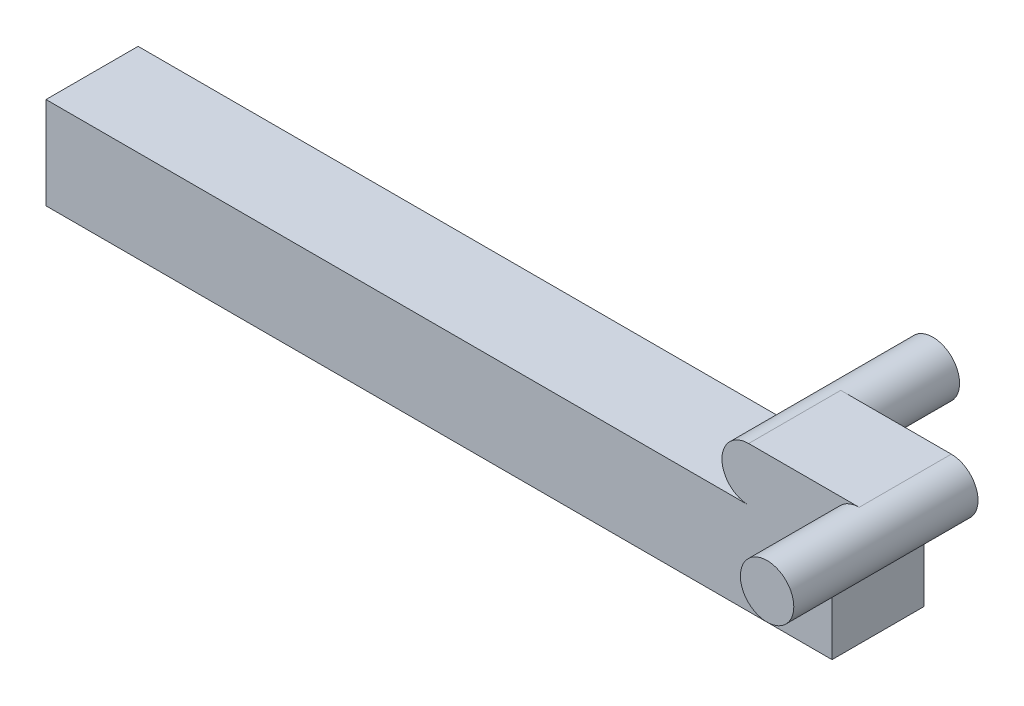
ISO-10303-21;
HEADER;
FILE_DESCRIPTION(('STEP AP214'),'2;1');
FILE_NAME('part.step','',(''),(''),'','','');
FILE_SCHEMA(('AUTOMOTIVE_DESIGN { 1 0 10303 214 1 1 1 1 }'));
ENDSEC;
DATA;
#1=APPLICATION_CONTEXT('core data for automotive mechanical design processes');
#2=APPLICATION_PROTOCOL_DEFINITION('international standard','automotive_design',2000,#1);
#3=PRODUCT_CONTEXT('',#1,'mechanical');
#4=PRODUCT('Part','Part','',(#3));
#5=PRODUCT_RELATED_PRODUCT_CATEGORY('part','',(#4));
#6=PRODUCT_DEFINITION_FORMATION('','',#4);
#7=PRODUCT_DEFINITION_CONTEXT('part definition',#1,'design');
#8=PRODUCT_DEFINITION('design','',#6,#7);
#9=PRODUCT_DEFINITION_SHAPE('','',#8);
#10=(LENGTH_UNIT() NAMED_UNIT(*) SI_UNIT(.MILLI.,.METRE.));
#11=(NAMED_UNIT(*) PLANE_ANGLE_UNIT() SI_UNIT($,.RADIAN.));
#12=(NAMED_UNIT(*) SI_UNIT($,.STERADIAN.) SOLID_ANGLE_UNIT());
#13=UNCERTAINTY_MEASURE_WITH_UNIT(LENGTH_MEASURE(1.E-05),#10,'distance_accuracy_value','');
#14=(GEOMETRIC_REPRESENTATION_CONTEXT(3) GLOBAL_UNCERTAINTY_ASSIGNED_CONTEXT((#13)) GLOBAL_UNIT_ASSIGNED_CONTEXT((#10,
#11,#12)) REPRESENTATION_CONTEXT('',''));
#15=CARTESIAN_POINT('',(0.,0.,0.));
#16=DIRECTION('',(0.,0.,1.));
#17=DIRECTION('',(1.,0.,0.));
#18=AXIS2_PLACEMENT_3D('',#15,#16,#17);
#19=CARTESIAN_POINT('',(0.,-1.45,5.));
#20=DIRECTION('',(0.,1.,0.));
#21=DIRECTION('',(0.,0.,1.));
#22=AXIS2_PLACEMENT_3D('',#19,#20,#21);
#23=PLANE('',#22);
#24=DIRECTION('',(0.,0.,1.));
#25=VECTOR('',#24,1.);
#26=CARTESIAN_POINT('',(4.5259378054856,-1.45,5.));
#27=LINE('',#26,#25);
#28=CARTESIAN_POINT('',(4.5259378054856,-1.45,0.));
#29=VERTEX_POINT('',#28);
#30=CARTESIAN_POINT('',(4.5259378054856,-1.45,5.));
#31=VERTEX_POINT('',#30);
#32=EDGE_CURVE('E149',#29,#31,#27,.T.);
#33=ORIENTED_EDGE('',*,*,#32,.F.);
#34=DIRECTION('',(1.,0.,0.));
#35=VECTOR('',#34,1.);
#36=CARTESIAN_POINT('',(0.,-1.45,0.));
#37=LINE('',#36,#35);
#38=CARTESIAN_POINT('',(6.,-1.45,0.));
#39=VERTEX_POINT('',#38);
#40=EDGE_CURVE('E93',#29,#39,#37,.T.);
#41=ORIENTED_EDGE('',*,*,#40,.T.);
#42=DIRECTION('',(0.,0.,-1.));
#43=VECTOR('',#42,1.);
#44=CARTESIAN_POINT('',(6.,-1.45,5.));
#45=LINE('',#44,#43);
#46=CARTESIAN_POINT('',(6.,-1.45,5.));
#47=VERTEX_POINT('',#46);
#48=EDGE_CURVE('E52',#47,#39,#45,.T.);
#49=ORIENTED_EDGE('',*,*,#48,.F.);
#50=DIRECTION('',(1.,0.,0.));
#51=VECTOR('',#50,1.);
#52=CARTESIAN_POINT('',(0.,-1.45,5.));
#53=LINE('',#52,#51);
#54=EDGE_CURVE('E112',#31,#47,#53,.T.);
#55=ORIENTED_EDGE('',*,*,#54,.F.);
#56=EDGE_LOOP('',(#33,#41,#49,#55));
#57=FACE_BOUND('',#56,.T.);
#58=ADVANCED_FACE('F43',(#57),#23,.F.);
#59=CARTESIAN_POINT('',(0.,0.,0.));
#60=DIRECTION('',(0.,0.,1.));
#61=DIRECTION('',(1.,0.,0.));
#62=AXIS2_PLACEMENT_3D('',#59,#60,#61);
#63=PLANE('',#62);
#64=CARTESIAN_POINT('',(0.,0.,0.));
#65=DIRECTION('',(0.,0.,-1.));
#66=DIRECTION('',(-1.,0.,0.));
#67=AXIS2_PLACEMENT_3D('',#64,#65,#66);
#68=CIRCLE('',#67,1.45);
#69=CARTESIAN_POINT('',(0.,1.45,0.));
#70=VERTEX_POINT('',#69);
#71=CARTESIAN_POINT('',(0.,-1.45,0.));
#72=VERTEX_POINT('',#71);
#73=EDGE_CURVE('E107',#70,#72,#68,.T.);
#74=ORIENTED_EDGE('',*,*,#73,.F.);
#75=DIRECTION('',(-1.,0.,0.));
#76=VECTOR('',#75,1.);
#77=CARTESIAN_POINT('',(0.,1.45,0.));
#78=LINE('',#77,#76);
#79=CARTESIAN_POINT('',(6.,1.45,0.));
#80=VERTEX_POINT('',#79);
#81=EDGE_CURVE('E92',#80,#70,#78,.T.);
#82=ORIENTED_EDGE('',*,*,#81,.F.);
#83=CARTESIAN_POINT('',(6.,0.,0.));
#84=DIRECTION('',(0.,0.,1.));
#85=DIRECTION('',(1.,0.,0.));
#86=AXIS2_PLACEMENT_3D('',#83,#84,#85);
#87=CIRCLE('',#86,1.45);
#88=EDGE_CURVE('E81',#39,#80,#87,.T.);
#89=ORIENTED_EDGE('',*,*,#88,.F.);
#90=ORIENTED_EDGE('',*,*,#40,.F.);
#91=DIRECTION('',(0.,1.,0.));
#92=VECTOR('',#91,1.);
#93=CARTESIAN_POINT('',(4.5259378054856,-6.45,0.));
#94=LINE('',#93,#92);
#95=CARTESIAN_POINT('',(4.5259378054856,-6.45,0.));
#96=VERTEX_POINT('',#95);
#97=EDGE_CURVE('E139',#96,#29,#94,.T.);
#98=ORIENTED_EDGE('',*,*,#97,.F.);
#99=DIRECTION('',(1.,0.,0.));
#100=VECTOR('',#99,1.);
#101=CARTESIAN_POINT('',(1.8555466458858,-6.45,0.));
#102=LINE('',#101,#100);
#103=CARTESIAN_POINT('',(-38.1444533541142,-6.45,0.));
#104=VERTEX_POINT('',#103);
#105=EDGE_CURVE('E152',#104,#96,#102,.T.);
#106=ORIENTED_EDGE('',*,*,#105,.F.);
#107=DIRECTION('',(0.,-1.,0.));
#108=VECTOR('',#107,1.);
#109=CARTESIAN_POINT('',(-38.1444533541142,-1.45,0.));
#110=LINE('',#109,#108);
#111=CARTESIAN_POINT('',(-38.1444533541142,-1.45,0.));
#112=VERTEX_POINT('',#111);
#113=EDGE_CURVE('E174',#112,#104,#110,.T.);
#114=ORIENTED_EDGE('',*,*,#113,.F.);
#115=DIRECTION('',(1.,0.,0.));
#116=VECTOR('',#115,1.);
#117=CARTESIAN_POINT('',(-38.1444533541142,-1.45,0.));
#118=LINE('',#117,#116);
#119=EDGE_CURVE('E167',#112,#72,#118,.T.);
#120=ORIENTED_EDGE('',*,*,#119,.T.);
#121=EDGE_LOOP('',(#74,#82,#89,#90,#98,#106,#114,#120));
#122=FACE_BOUND('',#121,.T.);
#123=ADVANCED_FACE('F104',(#122),#63,.F.);
#124=CARTESIAN_POINT('',(0.,0.,5.));
#125=DIRECTION('',(0.,0.,-1.));
#126=DIRECTION('',(-1.,0.,0.));
#127=AXIS2_PLACEMENT_3D('',#124,#125,#126);
#128=CYLINDRICAL_SURFACE('',#127,1.45);
#129=DIRECTION('',(0.,0.,-1.));
#130=VECTOR('',#129,1.);
#131=CARTESIAN_POINT('',(0.,1.45,5.));
#132=LINE('',#131,#130);
#133=CARTESIAN_POINT('',(0.,1.45,5.));
#134=VERTEX_POINT('',#133);
#135=EDGE_CURVE('E101',#134,#70,#132,.T.);
#136=ORIENTED_EDGE('',*,*,#135,.T.);
#137=ORIENTED_EDGE('',*,*,#73,.T.);
#138=DIRECTION('',(0.,0.,-1.));
#139=VECTOR('',#138,1.);
#140=CARTESIAN_POINT('',(0.,-1.45,5.));
#141=LINE('',#140,#139);
#142=CARTESIAN_POINT('',(0.,-1.45,5.));
#143=VERTEX_POINT('',#142);
#144=EDGE_CURVE('E11',#143,#72,#141,.T.);
#145=ORIENTED_EDGE('',*,*,#144,.F.);
#146=CARTESIAN_POINT('',(0.,0.,5.));
#147=DIRECTION('',(0.,0.,1.));
#148=DIRECTION('',(1.,0.,0.));
#149=AXIS2_PLACEMENT_3D('',#146,#147,#148);
#150=CIRCLE('',#149,1.45);
#151=EDGE_CURVE('E109',#134,#143,#150,.T.);
#152=ORIENTED_EDGE('',*,*,#151,.F.);
#153=EDGE_LOOP('',(#136,#137,#145,#152));
#154=FACE_BOUND('',#153,.T.);
#155=CARTESIAN_POINT('',(0.,0.,-5.));
#156=DIRECTION('',(0.,0.,-1.));
#157=DIRECTION('',(-1.,0.,0.));
#158=AXIS2_PLACEMENT_3D('',#155,#156,#157);
#159=CIRCLE('',#158,1.45);
#160=CARTESIAN_POINT('',(-1.45,0.,-5.));
#161=VERTEX_POINT('',#160);
#162=EDGE_CURVE('E135',#161,#161,#159,.T.);
#163=ORIENTED_EDGE('',*,*,#162,.F.);
#164=EDGE_LOOP('',(#163));
#165=FACE_BOUND('',#164,.T.);
#166=ADVANCED_FACE('F45',(#154,#165),#128,.T.);
#167=CARTESIAN_POINT('',(6.,0.,5.));
#168=DIRECTION('',(0.,0.,-1.));
#169=DIRECTION('',(-1.,0.,0.));
#170=AXIS2_PLACEMENT_3D('',#167,#168,#169);
#171=CYLINDRICAL_SURFACE('',#170,1.45);
#172=ORIENTED_EDGE('',*,*,#88,.T.);
#173=DIRECTION('',(0.,0.,-1.));
#174=VECTOR('',#173,1.);
#175=CARTESIAN_POINT('',(6.,1.45,5.));
#176=LINE('',#175,#174);
#177=CARTESIAN_POINT('',(6.,1.45,5.));
#178=VERTEX_POINT('',#177);
#179=EDGE_CURVE('E86',#178,#80,#176,.T.);
#180=ORIENTED_EDGE('',*,*,#179,.F.);
#181=CARTESIAN_POINT('',(6.,0.,5.));
#182=DIRECTION('',(0.,0.,1.));
#183=DIRECTION('',(1.,0.,0.));
#184=AXIS2_PLACEMENT_3D('',#181,#182,#183);
#185=CIRCLE('',#184,1.45);
#186=EDGE_CURVE('E130',#178,#47,#185,.T.);
#187=ORIENTED_EDGE('',*,*,#186,.T.);
#188=ORIENTED_EDGE('',*,*,#48,.T.);
#189=EDGE_LOOP('',(#172,#180,#187,#188));
#190=FACE_BOUND('',#189,.T.);
#191=CARTESIAN_POINT('',(6.,0.,10.));
#192=DIRECTION('',(0.,0.,1.));
#193=DIRECTION('',(1.,0.,0.));
#194=AXIS2_PLACEMENT_3D('',#191,#192,#193);
#195=CIRCLE('',#194,1.45);
#196=CARTESIAN_POINT('',(7.45,0.,10.));
#197=VERTEX_POINT('',#196);
#198=EDGE_CURVE('E125',#197,#197,#195,.T.);
#199=ORIENTED_EDGE('',*,*,#198,.F.);
#200=EDGE_LOOP('',(#199));
#201=FACE_BOUND('',#200,.T.);
#202=ADVANCED_FACE('F83',(#190,#201),#171,.T.);
#203=CARTESIAN_POINT('',(0.,1.45,5.));
#204=DIRECTION('',(0.,-1.,0.));
#205=DIRECTION('',(0.,0.,-1.));
#206=AXIS2_PLACEMENT_3D('',#203,#204,#205);
#207=PLANE('',#206);
#208=ORIENTED_EDGE('',*,*,#81,.T.);
#209=ORIENTED_EDGE('',*,*,#135,.F.);
#210=DIRECTION('',(-1.,0.,0.));
#211=VECTOR('',#210,1.);
#212=CARTESIAN_POINT('',(0.,1.45,5.));
#213=LINE('',#212,#211);
#214=EDGE_CURVE('E67',#178,#134,#213,.T.);
#215=ORIENTED_EDGE('',*,*,#214,.F.);
#216=ORIENTED_EDGE('',*,*,#179,.T.);
#217=EDGE_LOOP('',(#208,#209,#215,#216));
#218=FACE_BOUND('',#217,.T.);
#219=ADVANCED_FACE('F97',(#218),#207,.F.);
#220=CARTESIAN_POINT('',(0.,0.,5.));
#221=DIRECTION('',(0.,0.,1.));
#222=DIRECTION('',(1.,0.,0.));
#223=AXIS2_PLACEMENT_3D('',#220,#221,#222);
#224=PLANE('',#223);
#225=ORIENTED_EDGE('',*,*,#186,.F.);
#226=ORIENTED_EDGE('',*,*,#214,.T.);
#227=ORIENTED_EDGE('',*,*,#151,.T.);
#228=DIRECTION('',(1.,0.,0.));
#229=VECTOR('',#228,1.);
#230=CARTESIAN_POINT('',(-38.1444533541142,-1.45,5.));
#231=LINE('',#230,#229);
#232=CARTESIAN_POINT('',(-38.1444533541142,-1.45,5.));
#233=VERTEX_POINT('',#232);
#234=EDGE_CURVE('E153',#233,#143,#231,.T.);
#235=ORIENTED_EDGE('',*,*,#234,.F.);
#236=DIRECTION('',(0.,1.,0.));
#237=VECTOR('',#236,1.);
#238=CARTESIAN_POINT('',(-38.1444533541142,-1.45,5.));
#239=LINE('',#238,#237);
#240=CARTESIAN_POINT('',(-38.1444533541142,-6.45,5.));
#241=VERTEX_POINT('',#240);
#242=EDGE_CURVE('E182',#241,#233,#239,.T.);
#243=ORIENTED_EDGE('',*,*,#242,.F.);
#244=DIRECTION('',(-1.,0.,0.));
#245=VECTOR('',#244,1.);
#246=CARTESIAN_POINT('',(1.8555466458858,-6.45,5.));
#247=LINE('',#246,#245);
#248=CARTESIAN_POINT('',(4.5259378054856,-6.45,5.));
#249=VERTEX_POINT('',#248);
#250=EDGE_CURVE('E148',#249,#241,#247,.T.);
#251=ORIENTED_EDGE('',*,*,#250,.F.);
#252=DIRECTION('',(0.,1.,0.));
#253=VECTOR('',#252,1.);
#254=CARTESIAN_POINT('',(4.5259378054856,-6.45,5.));
#255=LINE('',#254,#253);
#256=EDGE_CURVE('E59',#249,#31,#255,.T.);
#257=ORIENTED_EDGE('',*,*,#256,.T.);
#258=ORIENTED_EDGE('',*,*,#54,.T.);
#259=EDGE_LOOP('',(#225,#226,#227,#235,#243,#251,#257,#258));
#260=FACE_BOUND('',#259,.T.);
#261=ADVANCED_FACE('F196',(#260),#224,.T.);
#262=CARTESIAN_POINT('',(6.,0.,10.));
#263=DIRECTION('',(0.,0.,1.));
#264=DIRECTION('',(1.,0.,0.));
#265=AXIS2_PLACEMENT_3D('',#262,#263,#264);
#266=PLANE('',#265);
#267=ORIENTED_EDGE('',*,*,#198,.T.);
#268=EDGE_LOOP('',(#267));
#269=FACE_BOUND('',#268,.T.);
#270=ADVANCED_FACE('F234',(#269),#266,.T.);
#271=CARTESIAN_POINT('',(0.,0.,-5.));
#272=DIRECTION('',(0.,0.,-1.));
#273=DIRECTION('',(-1.,0.,0.));
#274=AXIS2_PLACEMENT_3D('',#271,#272,#273);
#275=PLANE('',#274);
#276=ORIENTED_EDGE('',*,*,#162,.T.);
#277=EDGE_LOOP('',(#276));
#278=FACE_BOUND('',#277,.T.);
#279=ADVANCED_FACE('F237',(#278),#275,.T.);
#280=CARTESIAN_POINT('',(4.5259378054856,-6.45,5.));
#281=DIRECTION('',(-1.,0.,0.));
#282=DIRECTION('',(0.,0.,1.));
#283=AXIS2_PLACEMENT_3D('',#280,#281,#282);
#284=PLANE('',#283);
#285=ORIENTED_EDGE('',*,*,#32,.T.);
#286=ORIENTED_EDGE('',*,*,#256,.F.);
#287=DIRECTION('',(0.,0.,1.));
#288=VECTOR('',#287,1.);
#289=CARTESIAN_POINT('',(4.5259378054856,-6.45,5.));
#290=LINE('',#289,#288);
#291=EDGE_CURVE('E157',#96,#249,#290,.T.);
#292=ORIENTED_EDGE('',*,*,#291,.F.);
#293=ORIENTED_EDGE('',*,*,#97,.T.);
#294=EDGE_LOOP('',(#285,#286,#292,#293));
#295=FACE_BOUND('',#294,.T.);
#296=ADVANCED_FACE('F219',(#295),#284,.F.);
#297=CARTESIAN_POINT('',(0.,-6.45,0.));
#298=DIRECTION('',(0.,-1.,0.));
#299=DIRECTION('',(0.,0.,-1.));
#300=AXIS2_PLACEMENT_3D('',#297,#298,#299);
#301=PLANE('',#300);
#302=ORIENTED_EDGE('',*,*,#250,.T.);
#303=DIRECTION('',(0.,0.,1.));
#304=VECTOR('',#303,1.);
#305=CARTESIAN_POINT('',(-38.1444533541142,-6.45,5.));
#306=LINE('',#305,#304);
#307=EDGE_CURVE('E170',#104,#241,#306,.T.);
#308=ORIENTED_EDGE('',*,*,#307,.F.);
#309=ORIENTED_EDGE('',*,*,#105,.T.);
#310=ORIENTED_EDGE('',*,*,#291,.T.);
#311=EDGE_LOOP('',(#302,#308,#309,#310));
#312=FACE_BOUND('',#311,.T.);
#313=ADVANCED_FACE('F215',(#312),#301,.T.);
#314=CARTESIAN_POINT('',(-38.1444533541142,-1.45,5.));
#315=DIRECTION('',(0.,-1.,0.));
#316=DIRECTION('',(0.,0.,-1.));
#317=AXIS2_PLACEMENT_3D('',#314,#315,#316);
#318=PLANE('',#317);
#319=ORIENTED_EDGE('',*,*,#234,.T.);
#320=ORIENTED_EDGE('',*,*,#144,.T.);
#321=ORIENTED_EDGE('',*,*,#119,.F.);
#322=DIRECTION('',(0.,0.,-1.));
#323=VECTOR('',#322,1.);
#324=CARTESIAN_POINT('',(-38.1444533541142,-1.45,5.));
#325=LINE('',#324,#323);
#326=EDGE_CURVE('E178',#233,#112,#325,.T.);
#327=ORIENTED_EDGE('',*,*,#326,.F.);
#328=EDGE_LOOP('',(#319,#320,#321,#327));
#329=FACE_BOUND('',#328,.T.);
#330=ADVANCED_FACE('F201',(#329),#318,.F.);
#331=CARTESIAN_POINT('',(-38.1444533541142,0.,0.));
#332=DIRECTION('',(1.,0.,0.));
#333=DIRECTION('',(0.,0.,-1.));
#334=AXIS2_PLACEMENT_3D('',#331,#332,#333);
#335=PLANE('',#334);
#336=ORIENTED_EDGE('',*,*,#242,.T.);
#337=ORIENTED_EDGE('',*,*,#326,.T.);
#338=ORIENTED_EDGE('',*,*,#113,.T.);
#339=ORIENTED_EDGE('',*,*,#307,.T.);
#340=EDGE_LOOP('',(#336,#337,#338,#339));
#341=FACE_BOUND('',#340,.T.);
#342=ADVANCED_FACE('F189',(#341),#335,.F.);
#343=CLOSED_SHELL('',(#58,#123,#166,#202,#219,#261,#270,#279,#296,#313,#330,#342));
#344=MANIFOLD_SOLID_BREP('B2',#343);
#345=ADVANCED_BREP_SHAPE_REPRESENTATION('',(#18,#344),#14);
#346=SHAPE_DEFINITION_REPRESENTATION(#9,#345);
ENDSEC;
END-ISO-10303-21;
